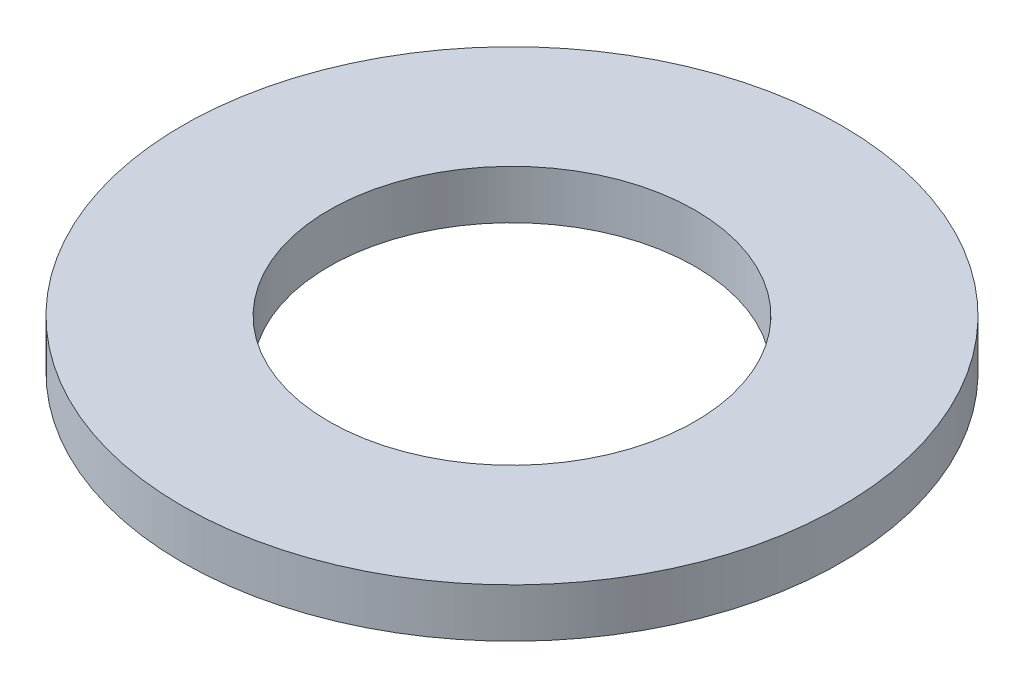
ISO-10303-21;
HEADER;
FILE_DESCRIPTION(('STEP AP214'),'2;1');
FILE_NAME('part.step','',(''),(''),'','','');
FILE_SCHEMA(('AUTOMOTIVE_DESIGN { 1 0 10303 214 1 1 1 1 }'));
ENDSEC;
DATA;
#1=APPLICATION_CONTEXT('core data for automotive mechanical design processes');
#2=APPLICATION_PROTOCOL_DEFINITION('international standard','automotive_design',2000,#1);
#3=PRODUCT_CONTEXT('',#1,'mechanical');
#4=PRODUCT('Part','Part','',(#3));
#5=PRODUCT_RELATED_PRODUCT_CATEGORY('part','',(#4));
#6=PRODUCT_DEFINITION_FORMATION('','',#4);
#7=PRODUCT_DEFINITION_CONTEXT('part definition',#1,'design');
#8=PRODUCT_DEFINITION('design','',#6,#7);
#9=PRODUCT_DEFINITION_SHAPE('','',#8);
#10=(LENGTH_UNIT() NAMED_UNIT(*) SI_UNIT(.MILLI.,.METRE.));
#11=(NAMED_UNIT(*) PLANE_ANGLE_UNIT() SI_UNIT($,.RADIAN.));
#12=(NAMED_UNIT(*) SI_UNIT($,.STERADIAN.) SOLID_ANGLE_UNIT());
#13=UNCERTAINTY_MEASURE_WITH_UNIT(LENGTH_MEASURE(1.E-05),#10,'distance_accuracy_value','');
#14=(GEOMETRIC_REPRESENTATION_CONTEXT(3) GLOBAL_UNCERTAINTY_ASSIGNED_CONTEXT((#13)) GLOBAL_UNIT_ASSIGNED_CONTEXT((#10,
#11,#12)) REPRESENTATION_CONTEXT('',''));
#15=CARTESIAN_POINT('',(0.,0.,0.));
#16=DIRECTION('',(0.,0.,1.));
#17=DIRECTION('',(1.,0.,0.));
#18=AXIS2_PLACEMENT_3D('',#15,#16,#17);
#19=CARTESIAN_POINT('',(0.,0.2,0.));
#20=DIRECTION('',(0.,1.,0.));
#21=DIRECTION('',(0.,0.,1.));
#22=AXIS2_PLACEMENT_3D('',#19,#20,#21);
#23=PLANE('',#22);
#24=CARTESIAN_POINT('',(0.,0.2,0.));
#25=DIRECTION('',(0.,1.,0.));
#26=DIRECTION('',(0.,0.,1.));
#27=AXIS2_PLACEMENT_3D('',#24,#25,#26);
#28=CIRCLE('',#27,1.35);
#29=CARTESIAN_POINT('',(0.,0.2,1.35));
#30=VERTEX_POINT('',#29);
#31=EDGE_CURVE('E10',#30,#30,#28,.T.);
#32=ORIENTED_EDGE('',*,*,#31,.T.);
#33=EDGE_LOOP('',(#32));
#34=FACE_BOUND('',#33,.T.);
#35=CARTESIAN_POINT('',(0.,0.2,0.));
#36=DIRECTION('',(0.,1.,0.));
#37=DIRECTION('',(0.,0.,1.));
#38=AXIS2_PLACEMENT_3D('',#35,#36,#37);
#39=CIRCLE('',#38,0.75);
#40=CARTESIAN_POINT('',(0.,0.2,0.75));
#41=VERTEX_POINT('',#40);
#42=EDGE_CURVE('E43',#41,#41,#39,.T.);
#43=ORIENTED_EDGE('',*,*,#42,.F.);
#44=EDGE_LOOP('',(#43));
#45=FACE_BOUND('',#44,.T.);
#46=ADVANCED_FACE('F32',(#34,#45),#23,.T.);
#47=CARTESIAN_POINT('',(0.,0.,0.));
#48=DIRECTION('',(0.,1.,0.));
#49=DIRECTION('',(0.,0.,1.));
#50=AXIS2_PLACEMENT_3D('',#47,#48,#49);
#51=PLANE('',#50);
#52=CARTESIAN_POINT('',(0.,0.,0.));
#53=DIRECTION('',(0.,1.,0.));
#54=DIRECTION('',(0.,0.,1.));
#55=AXIS2_PLACEMENT_3D('',#52,#53,#54);
#56=CIRCLE('',#55,1.35);
#57=CARTESIAN_POINT('',(0.,0.,1.35));
#58=VERTEX_POINT('',#57);
#59=EDGE_CURVE('E36',#58,#58,#56,.T.);
#60=ORIENTED_EDGE('',*,*,#59,.F.);
#61=EDGE_LOOP('',(#60));
#62=FACE_BOUND('',#61,.T.);
#63=CARTESIAN_POINT('',(0.,0.,0.));
#64=DIRECTION('',(0.,1.,0.));
#65=DIRECTION('',(0.,0.,1.));
#66=AXIS2_PLACEMENT_3D('',#63,#64,#65);
#67=CIRCLE('',#66,0.75);
#68=CARTESIAN_POINT('',(0.,0.,0.75));
#69=VERTEX_POINT('',#68);
#70=EDGE_CURVE('E45',#69,#69,#67,.T.);
#71=ORIENTED_EDGE('',*,*,#70,.T.);
#72=EDGE_LOOP('',(#71));
#73=FACE_BOUND('',#72,.T.);
#74=ADVANCED_FACE('F55',(#62,#73),#51,.F.);
#75=CARTESIAN_POINT('',(0.,0.2,0.));
#76=DIRECTION('',(0.,-1.,0.));
#77=DIRECTION('',(0.,0.,-1.));
#78=AXIS2_PLACEMENT_3D('',#75,#76,#77);
#79=CYLINDRICAL_SURFACE('',#78,1.35);
#80=ORIENTED_EDGE('',*,*,#31,.F.);
#81=EDGE_LOOP('',(#80));
#82=FACE_BOUND('',#81,.T.);
#83=ORIENTED_EDGE('',*,*,#59,.T.);
#84=EDGE_LOOP('',(#83));
#85=FACE_BOUND('',#84,.T.);
#86=ADVANCED_FACE('F34',(#82,#85),#79,.T.);
#87=CARTESIAN_POINT('',(0.,0.2,0.));
#88=DIRECTION('',(0.,-1.,0.));
#89=DIRECTION('',(0.,0.,-1.));
#90=AXIS2_PLACEMENT_3D('',#87,#88,#89);
#91=CYLINDRICAL_SURFACE('',#90,0.75);
#92=ORIENTED_EDGE('',*,*,#42,.T.);
#93=EDGE_LOOP('',(#92));
#94=FACE_BOUND('',#93,.T.);
#95=ORIENTED_EDGE('',*,*,#70,.F.);
#96=EDGE_LOOP('',(#95));
#97=FACE_BOUND('',#96,.T.);
#98=ADVANCED_FACE('F51',(#94,#97),#91,.F.);
#99=CLOSED_SHELL('',(#46,#74,#86,#98));
#100=MANIFOLD_SOLID_BREP('B2',#99);
#101=ADVANCED_BREP_SHAPE_REPRESENTATION('',(#18,#100),#14);
#102=SHAPE_DEFINITION_REPRESENTATION(#9,#101);
ENDSEC;
END-ISO-10303-21;
